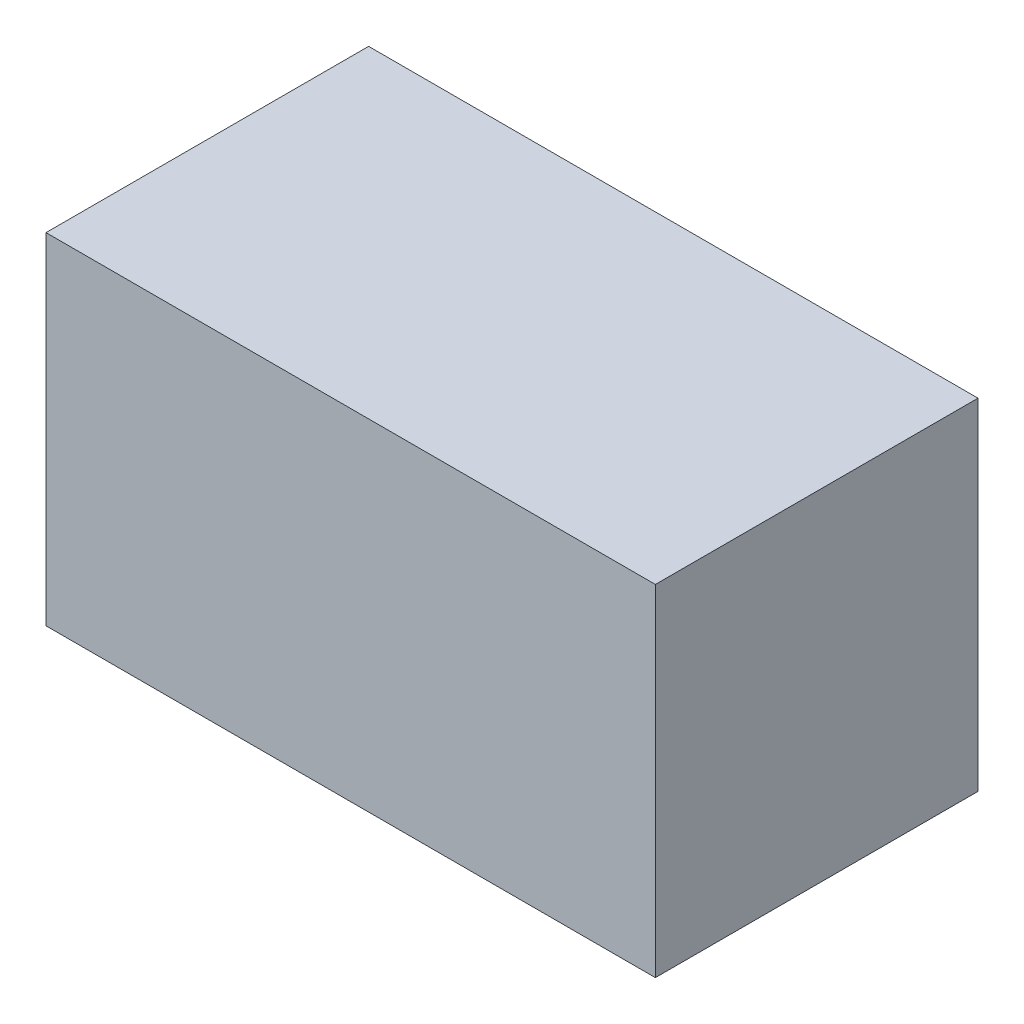
ISO-10303-21;
HEADER;
FILE_DESCRIPTION(('STEP AP214'),'2;1');
FILE_NAME('part.step','',(''),(''),'','','');
FILE_SCHEMA(('AUTOMOTIVE_DESIGN { 1 0 10303 214 1 1 1 1 }'));
ENDSEC;
DATA;
#1=APPLICATION_CONTEXT('core data for automotive mechanical design processes');
#2=APPLICATION_PROTOCOL_DEFINITION('international standard','automotive_design',2000,#1);
#3=PRODUCT_CONTEXT('',#1,'mechanical');
#4=PRODUCT('Part','Part','',(#3));
#5=PRODUCT_RELATED_PRODUCT_CATEGORY('part','',(#4));
#6=PRODUCT_DEFINITION_FORMATION('','',#4);
#7=PRODUCT_DEFINITION_CONTEXT('part definition',#1,'design');
#8=PRODUCT_DEFINITION('design','',#6,#7);
#9=PRODUCT_DEFINITION_SHAPE('','',#8);
#10=(LENGTH_UNIT() NAMED_UNIT(*) SI_UNIT(.MILLI.,.METRE.));
#11=(NAMED_UNIT(*) PLANE_ANGLE_UNIT() SI_UNIT($,.RADIAN.));
#12=(NAMED_UNIT(*) SI_UNIT($,.STERADIAN.) SOLID_ANGLE_UNIT());
#13=UNCERTAINTY_MEASURE_WITH_UNIT(LENGTH_MEASURE(1.E-05),#10,'distance_accuracy_value','');
#14=(GEOMETRIC_REPRESENTATION_CONTEXT(3) GLOBAL_UNCERTAINTY_ASSIGNED_CONTEXT((#13)) GLOBAL_UNIT_ASSIGNED_CONTEXT((#10,
#11,#12)) REPRESENTATION_CONTEXT('',''));
#15=CARTESIAN_POINT('',(0.,0.,0.));
#16=DIRECTION('',(0.,0.,1.));
#17=DIRECTION('',(1.,0.,0.));
#18=AXIS2_PLACEMENT_3D('',#15,#16,#17);
#19=CARTESIAN_POINT('',(-0.85000084,0.47500032,0.));
#20=DIRECTION('',(0.,1.,0.));
#21=DIRECTION('',(1.,0.,0.));
#22=AXIS2_PLACEMENT_3D('',#19,#20,#21);
#23=PLANE('',#22);
#24=DIRECTION('',(0.,0.,1.));
#25=VECTOR('',#24,1.);
#26=CARTESIAN_POINT('',(-0.85000084,0.47500032,0.));
#27=LINE('',#26,#25);
#28=CARTESIAN_POINT('',(-0.85000084,0.47500032,0.));
#29=VERTEX_POINT('',#28);
#30=CARTESIAN_POINT('',(-0.85000084,0.47500032,0.90000074));
#31=VERTEX_POINT('',#30);
#32=EDGE_CURVE('E11',#29,#31,#27,.T.);
#33=ORIENTED_EDGE('',*,*,#32,.T.);
#34=DIRECTION('',(1.,0.,0.));
#35=VECTOR('',#34,1.);
#36=CARTESIAN_POINT('',(-0.85000084,0.47500032,0.90000074));
#37=LINE('',#36,#35);
#38=CARTESIAN_POINT('',(0.85000084,0.47500032,0.90000074));
#39=VERTEX_POINT('',#38);
#40=EDGE_CURVE('E23',#31,#39,#37,.T.);
#41=ORIENTED_EDGE('',*,*,#40,.T.);
#42=DIRECTION('',(0.,0.,1.));
#43=VECTOR('',#42,1.);
#44=CARTESIAN_POINT('',(0.85000084,0.47500032,0.));
#45=LINE('',#44,#43);
#46=CARTESIAN_POINT('',(0.85000084,0.47500032,0.));
#47=VERTEX_POINT('',#46);
#48=EDGE_CURVE('E83',#47,#39,#45,.T.);
#49=ORIENTED_EDGE('',*,*,#48,.F.);
#50=DIRECTION('',(1.,0.,0.));
#51=VECTOR('',#50,1.);
#52=CARTESIAN_POINT('',(-0.85000084,0.47500032,0.));
#53=LINE('',#52,#51);
#54=EDGE_CURVE('E81',#29,#47,#53,.T.);
#55=ORIENTED_EDGE('',*,*,#54,.F.);
#56=EDGE_LOOP('',(#33,#41,#49,#55));
#57=FACE_BOUND('',#56,.T.);
#58=ADVANCED_FACE('F16',(#57),#23,.T.);
#59=CARTESIAN_POINT('',(0.85000084,0.47500032,0.));
#60=DIRECTION('',(1.,0.,0.));
#61=DIRECTION('',(0.,-1.,0.));
#62=AXIS2_PLACEMENT_3D('',#59,#60,#61);
#63=PLANE('',#62);
#64=ORIENTED_EDGE('',*,*,#48,.T.);
#65=DIRECTION('',(0.,-1.,0.));
#66=VECTOR('',#65,1.);
#67=CARTESIAN_POINT('',(0.85000084,0.47500032,0.90000074));
#68=LINE('',#67,#66);
#69=CARTESIAN_POINT('',(0.85000084,-0.47500032,0.90000074));
#70=VERTEX_POINT('',#69);
#71=EDGE_CURVE('E78',#39,#70,#68,.T.);
#72=ORIENTED_EDGE('',*,*,#71,.T.);
#73=DIRECTION('',(0.,0.,1.));
#74=VECTOR('',#73,1.);
#75=CARTESIAN_POINT('',(0.85000084,-0.47500032,0.));
#76=LINE('',#75,#74);
#77=CARTESIAN_POINT('',(0.85000084,-0.47500032,0.));
#78=VERTEX_POINT('',#77);
#79=EDGE_CURVE('E76',#78,#70,#76,.T.);
#80=ORIENTED_EDGE('',*,*,#79,.F.);
#81=DIRECTION('',(0.,-1.,0.));
#82=VECTOR('',#81,1.);
#83=CARTESIAN_POINT('',(0.85000084,0.47500032,0.));
#84=LINE('',#83,#82);
#85=EDGE_CURVE('E57',#47,#78,#84,.T.);
#86=ORIENTED_EDGE('',*,*,#85,.F.);
#87=EDGE_LOOP('',(#64,#72,#80,#86));
#88=FACE_BOUND('',#87,.T.);
#89=ADVANCED_FACE('F89',(#88),#63,.T.);
#90=CARTESIAN_POINT('',(0.85000084,-0.47500032,0.));
#91=DIRECTION('',(0.,-1.,0.));
#92=DIRECTION('',(-1.,0.,0.));
#93=AXIS2_PLACEMENT_3D('',#90,#91,#92);
#94=PLANE('',#93);
#95=ORIENTED_EDGE('',*,*,#79,.T.);
#96=DIRECTION('',(-1.,0.,0.));
#97=VECTOR('',#96,1.);
#98=CARTESIAN_POINT('',(0.85000084,-0.47500032,0.90000074));
#99=LINE('',#98,#97);
#100=CARTESIAN_POINT('',(-0.85000084,-0.47500032,0.90000074));
#101=VERTEX_POINT('',#100);
#102=EDGE_CURVE('E69',#70,#101,#99,.T.);
#103=ORIENTED_EDGE('',*,*,#102,.T.);
#104=DIRECTION('',(0.,0.,1.));
#105=VECTOR('',#104,1.);
#106=CARTESIAN_POINT('',(-0.85000084,-0.47500032,0.));
#107=LINE('',#106,#105);
#108=CARTESIAN_POINT('',(-0.85000084,-0.47500032,0.));
#109=VERTEX_POINT('',#108);
#110=EDGE_CURVE('E62',#109,#101,#107,.T.);
#111=ORIENTED_EDGE('',*,*,#110,.F.);
#112=DIRECTION('',(-1.,0.,0.));
#113=VECTOR('',#112,1.);
#114=CARTESIAN_POINT('',(0.85000084,-0.47500032,0.));
#115=LINE('',#114,#113);
#116=EDGE_CURVE('E53',#78,#109,#115,.T.);
#117=ORIENTED_EDGE('',*,*,#116,.F.);
#118=EDGE_LOOP('',(#95,#103,#111,#117));
#119=FACE_BOUND('',#118,.T.);
#120=ADVANCED_FACE('F68',(#119),#94,.T.);
#121=CARTESIAN_POINT('',(-0.85000084,-0.47500032,0.));
#122=DIRECTION('',(-1.,0.,0.));
#123=DIRECTION('',(0.,1.,0.));
#124=AXIS2_PLACEMENT_3D('',#121,#122,#123);
#125=PLANE('',#124);
#126=ORIENTED_EDGE('',*,*,#110,.T.);
#127=DIRECTION('',(0.,1.,0.));
#128=VECTOR('',#127,1.);
#129=CARTESIAN_POINT('',(-0.85000084,-0.47500032,0.90000074));
#130=LINE('',#129,#128);
#131=EDGE_CURVE('E63',#101,#31,#130,.T.);
#132=ORIENTED_EDGE('',*,*,#131,.T.);
#133=ORIENTED_EDGE('',*,*,#32,.F.);
#134=DIRECTION('',(0.,1.,0.));
#135=VECTOR('',#134,1.);
#136=CARTESIAN_POINT('',(-0.85000084,-0.47500032,0.));
#137=LINE('',#136,#135);
#138=EDGE_CURVE('E56',#109,#29,#137,.T.);
#139=ORIENTED_EDGE('',*,*,#138,.F.);
#140=EDGE_LOOP('',(#126,#132,#133,#139));
#141=FACE_BOUND('',#140,.T.);
#142=ADVANCED_FACE('F66',(#141),#125,.T.);
#143=CARTESIAN_POINT('',(0.,0.,0.));
#144=DIRECTION('',(0.,0.,-1.));
#145=DIRECTION('',(1.,0.,0.));
#146=AXIS2_PLACEMENT_3D('',#143,#144,#145);
#147=PLANE('',#146);
#148=ORIENTED_EDGE('',*,*,#54,.T.);
#149=ORIENTED_EDGE('',*,*,#85,.T.);
#150=ORIENTED_EDGE('',*,*,#116,.T.);
#151=ORIENTED_EDGE('',*,*,#138,.T.);
#152=EDGE_LOOP('',(#148,#149,#150,#151));
#153=FACE_BOUND('',#152,.T.);
#154=ADVANCED_FACE('F55',(#153),#147,.T.);
#155=CARTESIAN_POINT('',(0.,0.,0.90000074));
#156=DIRECTION('',(0.,0.,-1.));
#157=DIRECTION('',(1.,0.,0.));
#158=AXIS2_PLACEMENT_3D('',#155,#156,#157);
#159=PLANE('',#158);
#160=ORIENTED_EDGE('',*,*,#131,.F.);
#161=ORIENTED_EDGE('',*,*,#102,.F.);
#162=ORIENTED_EDGE('',*,*,#71,.F.);
#163=ORIENTED_EDGE('',*,*,#40,.F.);
#164=EDGE_LOOP('',(#160,#161,#162,#163));
#165=FACE_BOUND('',#164,.T.);
#166=ADVANCED_FACE('F90',(#165),#159,.F.);
#167=CLOSED_SHELL('',(#58,#89,#120,#142,#154,#166));
#168=MANIFOLD_SOLID_BREP('B1',#167);
#169=ADVANCED_BREP_SHAPE_REPRESENTATION('',(#18,#168),#14);
#170=SHAPE_DEFINITION_REPRESENTATION(#9,#169);
ENDSEC;
END-ISO-10303-21;
